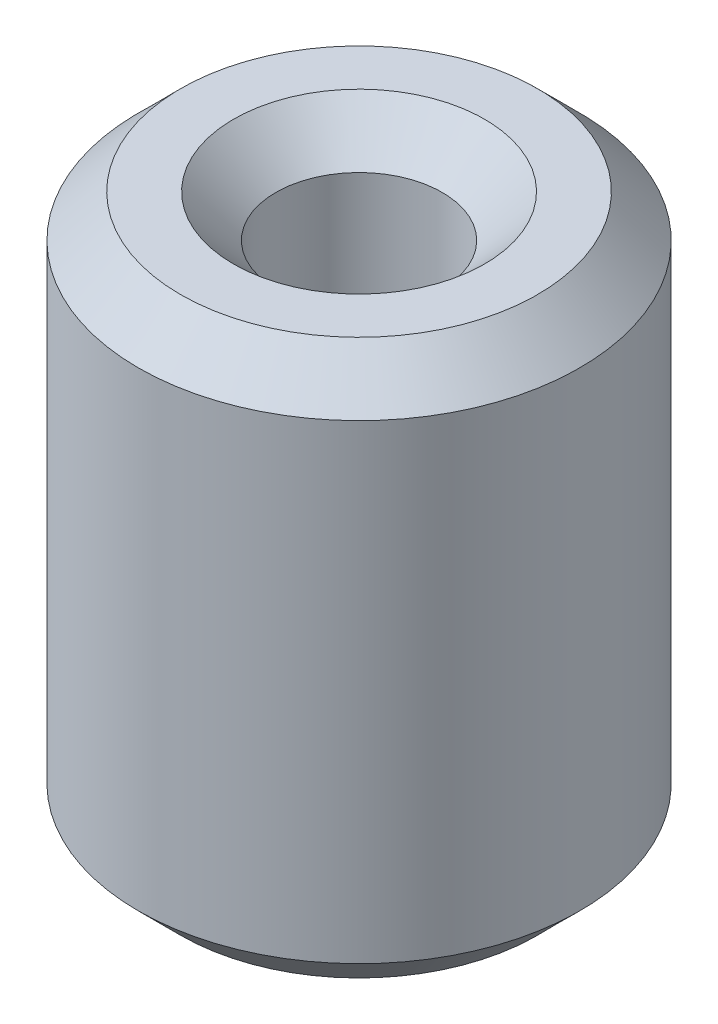
ISO-10303-21;
HEADER;
FILE_DESCRIPTION(('STEP AP214'),'2;1');
FILE_NAME('part.step','',(''),(''),'','','');
FILE_SCHEMA(('AUTOMOTIVE_DESIGN { 1 0 10303 214 1 1 1 1 }'));
ENDSEC;
DATA;
#1=APPLICATION_CONTEXT('core data for automotive mechanical design processes');
#2=APPLICATION_PROTOCOL_DEFINITION('international standard','automotive_design',2000,#1);
#3=PRODUCT_CONTEXT('',#1,'mechanical');
#4=PRODUCT('Part','Part','',(#3));
#5=PRODUCT_RELATED_PRODUCT_CATEGORY('part','',(#4));
#6=PRODUCT_DEFINITION_FORMATION('','',#4);
#7=PRODUCT_DEFINITION_CONTEXT('part definition',#1,'design');
#8=PRODUCT_DEFINITION('design','',#6,#7);
#9=PRODUCT_DEFINITION_SHAPE('','',#8);
#10=(LENGTH_UNIT() NAMED_UNIT(*) SI_UNIT(.MILLI.,.METRE.));
#11=(NAMED_UNIT(*) PLANE_ANGLE_UNIT() SI_UNIT($,.RADIAN.));
#12=(NAMED_UNIT(*) SI_UNIT($,.STERADIAN.) SOLID_ANGLE_UNIT());
#13=UNCERTAINTY_MEASURE_WITH_UNIT(LENGTH_MEASURE(1.E-05),#10,'distance_accuracy_value','');
#14=(GEOMETRIC_REPRESENTATION_CONTEXT(3) GLOBAL_UNCERTAINTY_ASSIGNED_CONTEXT((#13)) GLOBAL_UNIT_ASSIGNED_CONTEXT((#10,
#11,#12)) REPRESENTATION_CONTEXT('',''));
#15=CARTESIAN_POINT('',(0.,0.,0.));
#16=DIRECTION('',(0.,0.,1.));
#17=DIRECTION('',(1.,0.,0.));
#18=AXIS2_PLACEMENT_3D('',#15,#16,#17);
#19=CARTESIAN_POINT('',(0.,37.7073941178503,0.));
#20=DIRECTION('',(0.,-1.,0.));
#21=DIRECTION('',(0.,0.,-1.));
#22=AXIS2_PLACEMENT_3D('',#19,#20,#21);
#23=CYLINDRICAL_SURFACE('',#22,15.);
#24=CARTESIAN_POINT('',(0.,2.87325589666389,0.));
#25=DIRECTION('',(0.,1.,0.));
#26=DIRECTION('',(0.,0.,1.));
#27=AXIS2_PLACEMENT_3D('',#24,#25,#26);
#28=CIRCLE('',#27,15.);
#29=CARTESIAN_POINT('',(0.,2.87325589666389,15.));
#30=VERTEX_POINT('',#29);
#31=EDGE_CURVE('E10',#30,#30,#28,.T.);
#32=ORIENTED_EDGE('',*,*,#31,.T.);
#33=EDGE_LOOP('',(#32));
#34=FACE_BOUND('',#33,.T.);
#35=CARTESIAN_POINT('',(0.,34.8341382211864,0.));
#36=DIRECTION('',(0.,1.,0.));
#37=DIRECTION('',(0.,0.,1.));
#38=AXIS2_PLACEMENT_3D('',#35,#36,#37);
#39=CIRCLE('',#38,15.);
#40=CARTESIAN_POINT('',(0.,34.8341382211864,15.));
#41=VERTEX_POINT('',#40);
#42=EDGE_CURVE('E50',#41,#41,#39,.F.);
#43=ORIENTED_EDGE('',*,*,#42,.T.);
#44=EDGE_LOOP('',(#43));
#45=FACE_BOUND('',#44,.T.);
#46=ADVANCED_FACE('F39',(#34,#45),#23,.T.);
#47=CARTESIAN_POINT('',(0.,37.7073941178503,0.));
#48=DIRECTION('',(0.,1.,0.));
#49=DIRECTION('',(0.,0.,1.));
#50=AXIS2_PLACEMENT_3D('',#47,#48,#49);
#51=PLANE('',#50);
#52=CARTESIAN_POINT('',(0.,37.7073941178503,0.));
#53=DIRECTION('',(0.,1.,0.));
#54=DIRECTION('',(0.,0.,1.));
#55=AXIS2_PLACEMENT_3D('',#52,#53,#54);
#56=CIRCLE('',#55,8.52926025568831);
#57=CARTESIAN_POINT('',(0.,37.7073941178503,8.52926025568831));
#58=VERTEX_POINT('',#57);
#59=EDGE_CURVE('E58',#58,#58,#56,.F.);
#60=ORIENTED_EDGE('',*,*,#59,.T.);
#61=EDGE_LOOP('',(#60));
#62=FACE_BOUND('',#61,.T.);
#63=CARTESIAN_POINT('',(0.,37.7073941178503,0.));
#64=DIRECTION('',(0.,1.,0.));
#65=DIRECTION('',(0.,0.,1.));
#66=AXIS2_PLACEMENT_3D('',#63,#64,#65);
#67=CIRCLE('',#66,12.1267441033361);
#68=CARTESIAN_POINT('',(0.,37.7073941178503,12.1267441033361));
#69=VERTEX_POINT('',#68);
#70=EDGE_CURVE('E61',#69,#69,#67,.T.);
#71=ORIENTED_EDGE('',*,*,#70,.T.);
#72=EDGE_LOOP('',(#71));
#73=FACE_BOUND('',#72,.T.);
#74=ADVANCED_FACE('F88',(#62,#73),#51,.T.);
#75=CARTESIAN_POINT('',(0.,0.,0.));
#76=DIRECTION('',(0.,1.,0.));
#77=DIRECTION('',(0.,0.,1.));
#78=AXIS2_PLACEMENT_3D('',#75,#76,#77);
#79=PLANE('',#78);
#80=CARTESIAN_POINT('',(0.,0.,0.));
#81=DIRECTION('',(0.,1.,0.));
#82=DIRECTION('',(0.,0.,1.));
#83=AXIS2_PLACEMENT_3D('',#80,#81,#82);
#84=CIRCLE('',#83,8.52926025568829);
#85=CARTESIAN_POINT('',(0.,0.,8.52926025568829));
#86=VERTEX_POINT('',#85);
#87=EDGE_CURVE('E51',#86,#86,#84,.T.);
#88=ORIENTED_EDGE('',*,*,#87,.T.);
#89=EDGE_LOOP('',(#88));
#90=FACE_BOUND('',#89,.T.);
#91=CARTESIAN_POINT('',(0.,0.,0.));
#92=DIRECTION('',(0.,1.,0.));
#93=DIRECTION('',(0.,0.,1.));
#94=AXIS2_PLACEMENT_3D('',#91,#92,#93);
#95=CIRCLE('',#94,12.1267441033361);
#96=CARTESIAN_POINT('',(0.,0.,12.1267441033361));
#97=VERTEX_POINT('',#96);
#98=EDGE_CURVE('E54',#97,#97,#95,.F.);
#99=ORIENTED_EDGE('',*,*,#98,.T.);
#100=EDGE_LOOP('',(#99));
#101=FACE_BOUND('',#100,.T.);
#102=ADVANCED_FACE('F83',(#90,#101),#79,.F.);
#103=CARTESIAN_POINT('',(0.,37.7073941178503,0.));
#104=DIRECTION('',(0.,-1.,0.));
#105=DIRECTION('',(0.,0.,-1.));
#106=AXIS2_PLACEMENT_3D('',#103,#104,#105);
#107=CYLINDRICAL_SURFACE('',#106,5.65600435902439);
#108=CARTESIAN_POINT('',(0.,34.8341382211864,0.));
#109=DIRECTION('',(0.,1.,0.));
#110=DIRECTION('',(0.,0.,1.));
#111=AXIS2_PLACEMENT_3D('',#108,#109,#110);
#112=CIRCLE('',#111,5.65600435902439);
#113=CARTESIAN_POINT('',(0.,34.8341382211864,5.65600435902439));
#114=VERTEX_POINT('',#113);
#115=EDGE_CURVE('E67',#114,#114,#112,.T.);
#116=ORIENTED_EDGE('',*,*,#115,.T.);
#117=EDGE_LOOP('',(#116));
#118=FACE_BOUND('',#117,.T.);
#119=CARTESIAN_POINT('',(0.,2.87325589666392,0.));
#120=DIRECTION('',(0.,1.,0.));
#121=DIRECTION('',(0.,0.,1.));
#122=AXIS2_PLACEMENT_3D('',#119,#120,#121);
#123=CIRCLE('',#122,5.65600435902439);
#124=CARTESIAN_POINT('',(0.,2.87325589666392,5.65600435902439));
#125=VERTEX_POINT('',#124);
#126=EDGE_CURVE('E69',#125,#125,#123,.F.);
#127=ORIENTED_EDGE('',*,*,#126,.T.);
#128=EDGE_LOOP('',(#127));
#129=FACE_BOUND('',#128,.T.);
#130=ADVANCED_FACE('F71',(#118,#129),#107,.F.);
#131=CARTESIAN_POINT('',(0.,34.8341382211864,0.));
#132=DIRECTION('',(0.,1.,0.));
#133=DIRECTION('',(0.,0.,1.));
#134=AXIS2_PLACEMENT_3D('',#131,#132,#133);
#135=CONICAL_SURFACE('',#134,5.65600435902439,0.785398163397451);
#136=ORIENTED_EDGE('',*,*,#59,.F.);
#137=EDGE_LOOP('',(#136));
#138=FACE_BOUND('',#137,.T.);
#139=ORIENTED_EDGE('',*,*,#115,.F.);
#140=EDGE_LOOP('',(#139));
#141=FACE_BOUND('',#140,.T.);
#142=ADVANCED_FACE('F77',(#138,#141),#135,.F.);
#143=CARTESIAN_POINT('',(0.,0.,0.));
#144=DIRECTION('',(0.,-1.,0.));
#145=DIRECTION('',(0.,0.,-1.));
#146=AXIS2_PLACEMENT_3D('',#143,#144,#145);
#147=CONICAL_SURFACE('',#146,8.52926025568829,0.785398163397445);
#148=ORIENTED_EDGE('',*,*,#126,.F.);
#149=EDGE_LOOP('',(#148));
#150=FACE_BOUND('',#149,.T.);
#151=ORIENTED_EDGE('',*,*,#87,.F.);
#152=EDGE_LOOP('',(#151));
#153=FACE_BOUND('',#152,.T.);
#154=ADVANCED_FACE('F73',(#150,#153),#147,.F.);
#155=CARTESIAN_POINT('',(0.,2.87325589666389,0.));
#156=DIRECTION('',(0.,1.,0.));
#157=DIRECTION('',(0.,0.,1.));
#158=AXIS2_PLACEMENT_3D('',#155,#156,#157);
#159=CONICAL_SURFACE('',#158,15.,0.785398163397452);
#160=ORIENTED_EDGE('',*,*,#98,.F.);
#161=EDGE_LOOP('',(#160));
#162=FACE_BOUND('',#161,.T.);
#163=ORIENTED_EDGE('',*,*,#31,.F.);
#164=EDGE_LOOP('',(#163));
#165=FACE_BOUND('',#164,.T.);
#166=ADVANCED_FACE('F76',(#162,#165),#159,.T.);
#167=CARTESIAN_POINT('',(0.,37.7073941178503,0.));
#168=DIRECTION('',(0.,-1.,0.));
#169=DIRECTION('',(0.,0.,-1.));
#170=AXIS2_PLACEMENT_3D('',#167,#168,#169);
#171=CONICAL_SURFACE('',#170,12.1267441033361,0.785398163397445);
#172=ORIENTED_EDGE('',*,*,#42,.F.);
#173=EDGE_LOOP('',(#172));
#174=FACE_BOUND('',#173,.T.);
#175=ORIENTED_EDGE('',*,*,#70,.F.);
#176=EDGE_LOOP('',(#175));
#177=FACE_BOUND('',#176,.T.);
#178=ADVANCED_FACE('F45',(#174,#177),#171,.T.);
#179=CLOSED_SHELL('',(#46,#74,#102,#130,#142,#154,#166,#178));
#180=MANIFOLD_SOLID_BREP('B2',#179);
#181=ADVANCED_BREP_SHAPE_REPRESENTATION('',(#18,#180),#14);
#182=SHAPE_DEFINITION_REPRESENTATION(#9,#181);
ENDSEC;
END-ISO-10303-21;
